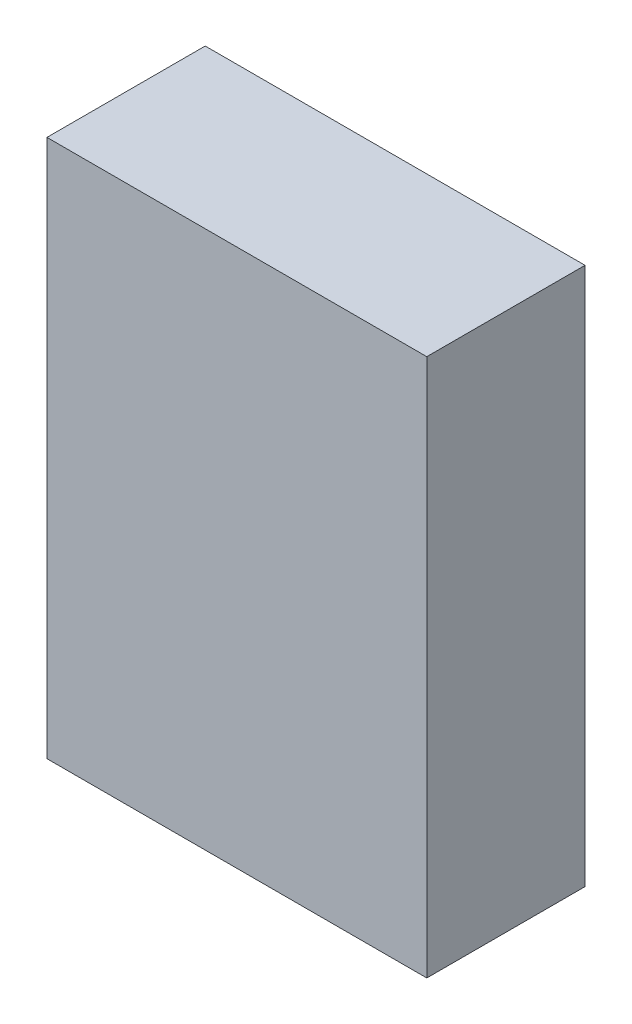
ISO-10303-21;
HEADER;
FILE_DESCRIPTION(('STEP AP214'),'2;1');
FILE_NAME('part.step','',(''),(''),'','','');
FILE_SCHEMA(('AUTOMOTIVE_DESIGN { 1 0 10303 214 1 1 1 1 }'));
ENDSEC;
DATA;
#1=APPLICATION_CONTEXT('core data for automotive mechanical design processes');
#2=APPLICATION_PROTOCOL_DEFINITION('international standard','automotive_design',2000,#1);
#3=PRODUCT_CONTEXT('',#1,'mechanical');
#4=PRODUCT('Part','Part','',(#3));
#5=PRODUCT_RELATED_PRODUCT_CATEGORY('part','',(#4));
#6=PRODUCT_DEFINITION_FORMATION('','',#4);
#7=PRODUCT_DEFINITION_CONTEXT('part definition',#1,'design');
#8=PRODUCT_DEFINITION('design','',#6,#7);
#9=PRODUCT_DEFINITION_SHAPE('','',#8);
#10=(LENGTH_UNIT() NAMED_UNIT(*) SI_UNIT(.MILLI.,.METRE.));
#11=(NAMED_UNIT(*) PLANE_ANGLE_UNIT() SI_UNIT($,.RADIAN.));
#12=(NAMED_UNIT(*) SI_UNIT($,.STERADIAN.) SOLID_ANGLE_UNIT());
#13=UNCERTAINTY_MEASURE_WITH_UNIT(LENGTH_MEASURE(1.E-05),#10,'distance_accuracy_value','');
#14=(GEOMETRIC_REPRESENTATION_CONTEXT(3) GLOBAL_UNCERTAINTY_ASSIGNED_CONTEXT((#13)) GLOBAL_UNIT_ASSIGNED_CONTEXT((#10,
#11,#12)) REPRESENTATION_CONTEXT('',''));
#15=CARTESIAN_POINT('',(0.,0.,0.));
#16=DIRECTION('',(0.,0.,1.));
#17=DIRECTION('',(1.,0.,0.));
#18=AXIS2_PLACEMENT_3D('',#15,#16,#17);
#19=CARTESIAN_POINT('',(0.63,2.58,0.));
#20=DIRECTION('',(1.,0.,0.));
#21=DIRECTION('',(0.,0.,1.));
#22=AXIS2_PLACEMENT_3D('',#19,#20,#21);
#23=PLANE('',#22);
#24=DIRECTION('',(0.,1.,0.));
#25=VECTOR('',#24,1.);
#26=CARTESIAN_POINT('',(0.63,2.58,0.1));
#27=LINE('',#26,#25);
#28=CARTESIAN_POINT('',(0.63,2.58,0.1));
#29=VERTEX_POINT('',#28);
#30=CARTESIAN_POINT('',(0.63,2.92,0.1));
#31=VERTEX_POINT('',#30);
#32=EDGE_CURVE('E11',#29,#31,#27,.T.);
#33=ORIENTED_EDGE('',*,*,#32,.T.);
#34=DIRECTION('',(0.,0.,1.));
#35=VECTOR('',#34,1.);
#36=CARTESIAN_POINT('',(0.63,2.92,0.));
#37=LINE('',#36,#35);
#38=CARTESIAN_POINT('',(0.63,2.92,0.));
#39=VERTEX_POINT('',#38);
#40=EDGE_CURVE('E24',#39,#31,#37,.T.);
#41=ORIENTED_EDGE('',*,*,#40,.F.);
#42=DIRECTION('',(0.,1.,0.));
#43=VECTOR('',#42,1.);
#44=CARTESIAN_POINT('',(0.63,2.58,0.));
#45=LINE('',#44,#43);
#46=CARTESIAN_POINT('',(0.63,2.58,0.));
#47=VERTEX_POINT('',#46);
#48=EDGE_CURVE('E86',#47,#39,#45,.T.);
#49=ORIENTED_EDGE('',*,*,#48,.F.);
#50=DIRECTION('',(0.,0.,1.));
#51=VECTOR('',#50,1.);
#52=CARTESIAN_POINT('',(0.63,2.58,0.));
#53=LINE('',#52,#51);
#54=EDGE_CURVE('E36',#47,#29,#53,.T.);
#55=ORIENTED_EDGE('',*,*,#54,.T.);
#56=EDGE_LOOP('',(#33,#41,#49,#55));
#57=FACE_BOUND('',#56,.T.);
#58=ADVANCED_FACE('F17',(#57),#23,.F.);
#59=CARTESIAN_POINT('',(0.87,2.58,0.));
#60=DIRECTION('',(1.,0.,0.));
#61=DIRECTION('',(0.,0.,1.));
#62=AXIS2_PLACEMENT_3D('',#59,#60,#61);
#63=PLANE('',#62);
#64=DIRECTION('',(0.,0.,1.));
#65=VECTOR('',#64,1.);
#66=CARTESIAN_POINT('',(0.87,2.58,0.));
#67=LINE('',#66,#65);
#68=CARTESIAN_POINT('',(0.87,2.58,0.));
#69=VERTEX_POINT('',#68);
#70=CARTESIAN_POINT('',(0.87,2.58,0.1));
#71=VERTEX_POINT('',#70);
#72=EDGE_CURVE('E83',#69,#71,#67,.T.);
#73=ORIENTED_EDGE('',*,*,#72,.F.);
#74=DIRECTION('',(0.,1.,0.));
#75=VECTOR('',#74,1.);
#76=CARTESIAN_POINT('',(0.87,2.58,0.));
#77=LINE('',#76,#75);
#78=CARTESIAN_POINT('',(0.87,2.92,0.));
#79=VERTEX_POINT('',#78);
#80=EDGE_CURVE('E63',#69,#79,#77,.T.);
#81=ORIENTED_EDGE('',*,*,#80,.T.);
#82=DIRECTION('',(0.,0.,1.));
#83=VECTOR('',#82,1.);
#84=CARTESIAN_POINT('',(0.87,2.92,0.));
#85=LINE('',#84,#83);
#86=CARTESIAN_POINT('',(0.87,2.92,0.1));
#87=VERTEX_POINT('',#86);
#88=EDGE_CURVE('E57',#79,#87,#85,.T.);
#89=ORIENTED_EDGE('',*,*,#88,.T.);
#90=DIRECTION('',(0.,1.,0.));
#91=VECTOR('',#90,1.);
#92=CARTESIAN_POINT('',(0.87,2.58,0.1));
#93=LINE('',#92,#91);
#94=EDGE_CURVE('E60',#71,#87,#93,.T.);
#95=ORIENTED_EDGE('',*,*,#94,.F.);
#96=EDGE_LOOP('',(#73,#81,#89,#95));
#97=FACE_BOUND('',#96,.T.);
#98=ADVANCED_FACE('F59',(#97),#63,.T.);
#99=CARTESIAN_POINT('',(0.63,2.58,0.));
#100=DIRECTION('',(0.,1.,0.));
#101=DIRECTION('',(0.,0.,1.));
#102=AXIS2_PLACEMENT_3D('',#99,#100,#101);
#103=PLANE('',#102);
#104=ORIENTED_EDGE('',*,*,#72,.T.);
#105=DIRECTION('',(1.,0.,0.));
#106=VECTOR('',#105,1.);
#107=CARTESIAN_POINT('',(0.63,2.58,0.1));
#108=LINE('',#107,#106);
#109=EDGE_CURVE('E71',#29,#71,#108,.T.);
#110=ORIENTED_EDGE('',*,*,#109,.F.);
#111=ORIENTED_EDGE('',*,*,#54,.F.);
#112=DIRECTION('',(1.,0.,0.));
#113=VECTOR('',#112,1.);
#114=CARTESIAN_POINT('',(0.63,2.58,0.));
#115=LINE('',#114,#113);
#116=EDGE_CURVE('E76',#47,#69,#115,.T.);
#117=ORIENTED_EDGE('',*,*,#116,.T.);
#118=EDGE_LOOP('',(#104,#110,#111,#117));
#119=FACE_BOUND('',#118,.T.);
#120=ADVANCED_FACE('F91',(#119),#103,.F.);
#121=CARTESIAN_POINT('',(0.63,2.92,0.));
#122=DIRECTION('',(0.,1.,0.));
#123=DIRECTION('',(0.,0.,1.));
#124=AXIS2_PLACEMENT_3D('',#121,#122,#123);
#125=PLANE('',#124);
#126=DIRECTION('',(1.,0.,0.));
#127=VECTOR('',#126,1.);
#128=CARTESIAN_POINT('',(0.63,2.92,0.));
#129=LINE('',#128,#127);
#130=EDGE_CURVE('E74',#39,#79,#129,.T.);
#131=ORIENTED_EDGE('',*,*,#130,.F.);
#132=ORIENTED_EDGE('',*,*,#40,.T.);
#133=DIRECTION('',(1.,0.,0.));
#134=VECTOR('',#133,1.);
#135=CARTESIAN_POINT('',(0.63,2.92,0.1));
#136=LINE('',#135,#134);
#137=EDGE_CURVE('E69',#31,#87,#136,.T.);
#138=ORIENTED_EDGE('',*,*,#137,.T.);
#139=ORIENTED_EDGE('',*,*,#88,.F.);
#140=EDGE_LOOP('',(#131,#132,#138,#139));
#141=FACE_BOUND('',#140,.T.);
#142=ADVANCED_FACE('F73',(#141),#125,.T.);
#143=CARTESIAN_POINT('',(0.63,2.58,0.));
#144=DIRECTION('',(0.,0.,1.));
#145=DIRECTION('',(1.,0.,0.));
#146=AXIS2_PLACEMENT_3D('',#143,#144,#145);
#147=PLANE('',#146);
#148=ORIENTED_EDGE('',*,*,#130,.T.);
#149=ORIENTED_EDGE('',*,*,#80,.F.);
#150=ORIENTED_EDGE('',*,*,#116,.F.);
#151=ORIENTED_EDGE('',*,*,#48,.T.);
#152=EDGE_LOOP('',(#148,#149,#150,#151));
#153=FACE_BOUND('',#152,.T.);
#154=ADVANCED_FACE('F89',(#153),#147,.F.);
#155=CARTESIAN_POINT('',(0.63,2.58,0.1));
#156=DIRECTION('',(0.,0.,1.));
#157=DIRECTION('',(1.,0.,0.));
#158=AXIS2_PLACEMENT_3D('',#155,#156,#157);
#159=PLANE('',#158);
#160=ORIENTED_EDGE('',*,*,#32,.F.);
#161=ORIENTED_EDGE('',*,*,#109,.T.);
#162=ORIENTED_EDGE('',*,*,#94,.T.);
#163=ORIENTED_EDGE('',*,*,#137,.F.);
#164=EDGE_LOOP('',(#160,#161,#162,#163));
#165=FACE_BOUND('',#164,.T.);
#166=ADVANCED_FACE('F68',(#165),#159,.T.);
#167=CLOSED_SHELL('',(#58,#98,#120,#142,#154,#166));
#168=MANIFOLD_SOLID_BREP('B1',#167);
#169=ADVANCED_BREP_SHAPE_REPRESENTATION('',(#18,#168),#14);
#170=SHAPE_DEFINITION_REPRESENTATION(#9,#169);
ENDSEC;
END-ISO-10303-21;
